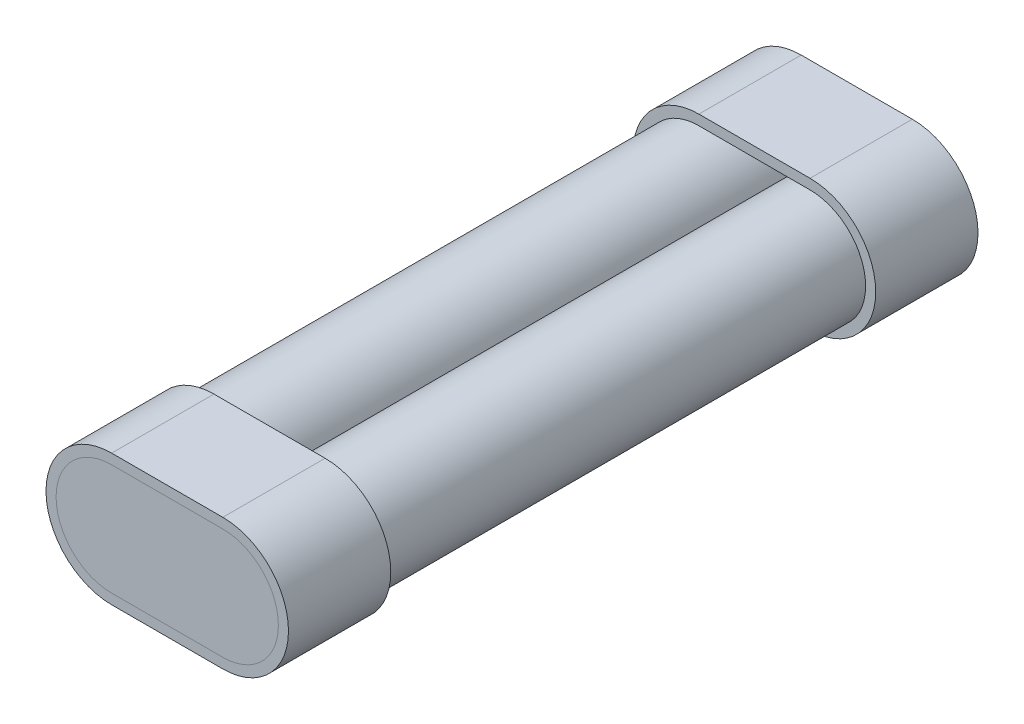
ISO-10303-21;
HEADER;
FILE_DESCRIPTION(('STEP AP214'),'2;1');
FILE_NAME('part.step','',(''),(''),'','','');
FILE_SCHEMA(('AUTOMOTIVE_DESIGN { 1 0 10303 214 1 1 1 1 }'));
ENDSEC;
DATA;
#1=APPLICATION_CONTEXT('core data for automotive mechanical design processes');
#2=APPLICATION_PROTOCOL_DEFINITION('international standard','automotive_design',2000,#1);
#3=PRODUCT_CONTEXT('',#1,'mechanical');
#4=PRODUCT('Part','Part','',(#3));
#5=PRODUCT_RELATED_PRODUCT_CATEGORY('part','',(#4));
#6=PRODUCT_DEFINITION_FORMATION('','',#4);
#7=PRODUCT_DEFINITION_CONTEXT('part definition',#1,'design');
#8=PRODUCT_DEFINITION('design','',#6,#7);
#9=PRODUCT_DEFINITION_SHAPE('','',#8);
#10=(LENGTH_UNIT() NAMED_UNIT(*) SI_UNIT(.MILLI.,.METRE.));
#11=(NAMED_UNIT(*) PLANE_ANGLE_UNIT() SI_UNIT($,.RADIAN.));
#12=(NAMED_UNIT(*) SI_UNIT($,.STERADIAN.) SOLID_ANGLE_UNIT());
#13=UNCERTAINTY_MEASURE_WITH_UNIT(LENGTH_MEASURE(1.E-05),#10,'distance_accuracy_value','');
#14=(GEOMETRIC_REPRESENTATION_CONTEXT(3) GLOBAL_UNCERTAINTY_ASSIGNED_CONTEXT((#13)) GLOBAL_UNIT_ASSIGNED_CONTEXT((#10,
#11,#12)) REPRESENTATION_CONTEXT('',''));
#15=CARTESIAN_POINT('',(0.,0.,0.));
#16=DIRECTION('',(0.,0.,1.));
#17=DIRECTION('',(1.,0.,0.));
#18=AXIS2_PLACEMENT_3D('',#15,#16,#17);
#19=CARTESIAN_POINT('',(0.,-11.,-134.5));
#20=DIRECTION('',(0.,1.,0.));
#21=DIRECTION('',(-1.,0.,0.));
#22=AXIS2_PLACEMENT_3D('',#19,#20,#21);
#23=PLANE('',#22);
#24=DIRECTION('',(-1.,0.,0.));
#25=VECTOR('',#24,1.);
#26=CARTESIAN_POINT('',(0.,-11.,-132.5));
#27=LINE('',#26,#25);
#28=CARTESIAN_POINT('',(11.,-11.,-132.5));
#29=VERTEX_POINT('',#28);
#30=CARTESIAN_POINT('',(-11.,-11.,-132.5));
#31=VERTEX_POINT('',#30);
#32=EDGE_CURVE('E118',#29,#31,#27,.T.);
#33=ORIENTED_EDGE('',*,*,#32,.T.);
#34=DIRECTION('',(0.,0.,1.));
#35=VECTOR('',#34,1.);
#36=CARTESIAN_POINT('',(-11.,-11.,-134.5));
#37=LINE('',#36,#35);
#38=CARTESIAN_POINT('',(-11.,-11.,-134.5));
#39=VERTEX_POINT('',#38);
#40=EDGE_CURVE('E13',#39,#31,#37,.T.);
#41=ORIENTED_EDGE('',*,*,#40,.F.);
#42=DIRECTION('',(-1.,0.,0.));
#43=VECTOR('',#42,1.);
#44=CARTESIAN_POINT('',(0.,-11.,-134.5));
#45=LINE('',#44,#43);
#46=CARTESIAN_POINT('',(11.,-11.,-134.5));
#47=VERTEX_POINT('',#46);
#48=EDGE_CURVE('E103',#47,#39,#45,.T.);
#49=ORIENTED_EDGE('',*,*,#48,.F.);
#50=DIRECTION('',(0.,0.,1.));
#51=VECTOR('',#50,1.);
#52=CARTESIAN_POINT('',(11.,-11.,-134.5));
#53=LINE('',#52,#51);
#54=EDGE_CURVE('E114',#47,#29,#53,.T.);
#55=ORIENTED_EDGE('',*,*,#54,.T.);
#56=EDGE_LOOP('',(#33,#41,#49,#55));
#57=FACE_BOUND('',#56,.T.);
#58=ADVANCED_FACE('F56',(#57),#23,.F.);
#59=CARTESIAN_POINT('',(-11.,0.,-134.5));
#60=DIRECTION('',(0.,0.,1.));
#61=DIRECTION('',(1.,0.,0.));
#62=AXIS2_PLACEMENT_3D('',#59,#60,#61);
#63=CYLINDRICAL_SURFACE('',#62,11.);
#64=CARTESIAN_POINT('',(-11.,0.,-132.5));
#65=DIRECTION('',(0.,0.,-1.));
#66=DIRECTION('',(-1.,0.,0.));
#67=AXIS2_PLACEMENT_3D('',#64,#65,#66);
#68=CIRCLE('',#67,11.);
#69=CARTESIAN_POINT('',(-11.,11.,-132.5));
#70=VERTEX_POINT('',#69);
#71=EDGE_CURVE('E108',#31,#70,#68,.T.);
#72=ORIENTED_EDGE('',*,*,#71,.T.);
#73=DIRECTION('',(0.,0.,1.));
#74=VECTOR('',#73,1.);
#75=CARTESIAN_POINT('',(-11.,11.,-134.5));
#76=LINE('',#75,#74);
#77=CARTESIAN_POINT('',(-11.,11.,-134.5));
#78=VERTEX_POINT('',#77);
#79=EDGE_CURVE('E64',#78,#70,#76,.T.);
#80=ORIENTED_EDGE('',*,*,#79,.F.);
#81=CARTESIAN_POINT('',(-11.,0.,-134.5));
#82=DIRECTION('',(0.,0.,-1.));
#83=DIRECTION('',(-1.,0.,0.));
#84=AXIS2_PLACEMENT_3D('',#81,#82,#83);
#85=CIRCLE('',#84,11.);
#86=EDGE_CURVE('E98',#39,#78,#85,.T.);
#87=ORIENTED_EDGE('',*,*,#86,.F.);
#88=ORIENTED_EDGE('',*,*,#40,.T.);
#89=EDGE_LOOP('',(#72,#80,#87,#88));
#90=FACE_BOUND('',#89,.T.);
#91=ADVANCED_FACE('F107',(#90),#63,.T.);
#92=CARTESIAN_POINT('',(0.,11.,-134.5));
#93=DIRECTION('',(0.,1.,0.));
#94=DIRECTION('',(-1.,0.,0.));
#95=AXIS2_PLACEMENT_3D('',#92,#93,#94);
#96=PLANE('',#95);
#97=DIRECTION('',(-1.,0.,0.));
#98=VECTOR('',#97,1.);
#99=CARTESIAN_POINT('',(0.,11.,-132.5));
#100=LINE('',#99,#98);
#101=CARTESIAN_POINT('',(11.,11.,-132.5));
#102=VERTEX_POINT('',#101);
#103=EDGE_CURVE('E122',#102,#70,#100,.T.);
#104=ORIENTED_EDGE('',*,*,#103,.F.);
#105=DIRECTION('',(0.,0.,1.));
#106=VECTOR('',#105,1.);
#107=CARTESIAN_POINT('',(11.,11.,-134.5));
#108=LINE('',#107,#106);
#109=CARTESIAN_POINT('',(11.,11.,-134.5));
#110=VERTEX_POINT('',#109);
#111=EDGE_CURVE('E88',#110,#102,#108,.T.);
#112=ORIENTED_EDGE('',*,*,#111,.F.);
#113=DIRECTION('',(-1.,0.,0.));
#114=VECTOR('',#113,1.);
#115=CARTESIAN_POINT('',(0.,11.,-134.5));
#116=LINE('',#115,#114);
#117=EDGE_CURVE('E101',#110,#78,#116,.T.);
#118=ORIENTED_EDGE('',*,*,#117,.T.);
#119=ORIENTED_EDGE('',*,*,#79,.T.);
#120=EDGE_LOOP('',(#104,#112,#118,#119));
#121=FACE_BOUND('',#120,.T.);
#122=ADVANCED_FACE('F112',(#121),#96,.T.);
#123=CARTESIAN_POINT('',(11.,0.,-134.5));
#124=DIRECTION('',(0.,0.,1.));
#125=DIRECTION('',(1.,0.,0.));
#126=AXIS2_PLACEMENT_3D('',#123,#124,#125);
#127=CYLINDRICAL_SURFACE('',#126,11.);
#128=CARTESIAN_POINT('',(11.,0.,-132.5));
#129=DIRECTION('',(0.,0.,-1.));
#130=DIRECTION('',(-1.,0.,0.));
#131=AXIS2_PLACEMENT_3D('',#128,#129,#130);
#132=CIRCLE('',#131,11.);
#133=EDGE_CURVE('E91',#102,#29,#132,.T.);
#134=ORIENTED_EDGE('',*,*,#133,.T.);
#135=ORIENTED_EDGE('',*,*,#54,.F.);
#136=CARTESIAN_POINT('',(11.,0.,-134.5));
#137=DIRECTION('',(0.,0.,-1.));
#138=DIRECTION('',(-1.,0.,0.));
#139=AXIS2_PLACEMENT_3D('',#136,#137,#138);
#140=CIRCLE('',#139,11.);
#141=EDGE_CURVE('E72',#110,#47,#140,.T.);
#142=ORIENTED_EDGE('',*,*,#141,.F.);
#143=ORIENTED_EDGE('',*,*,#111,.T.);
#144=EDGE_LOOP('',(#134,#135,#142,#143));
#145=FACE_BOUND('',#144,.T.);
#146=ADVANCED_FACE('F135',(#145),#127,.T.);
#147=CARTESIAN_POINT('',(0.,0.,-134.5));
#148=DIRECTION('',(0.,0.,-1.));
#149=DIRECTION('',(-1.,0.,0.));
#150=AXIS2_PLACEMENT_3D('',#147,#148,#149);
#151=PLANE('',#150);
#152=ORIENTED_EDGE('',*,*,#48,.T.);
#153=ORIENTED_EDGE('',*,*,#86,.T.);
#154=ORIENTED_EDGE('',*,*,#117,.F.);
#155=ORIENTED_EDGE('',*,*,#141,.T.);
#156=EDGE_LOOP('',(#152,#153,#154,#155));
#157=FACE_BOUND('',#156,.T.);
#158=ADVANCED_FACE('F99',(#157),#151,.T.);
#159=CARTESIAN_POINT('',(0.,0.,-132.5));
#160=DIRECTION('',(0.,0.,-1.));
#161=DIRECTION('',(-1.,0.,0.));
#162=AXIS2_PLACEMENT_3D('',#159,#160,#161);
#163=PLANE('',#162);
#164=ORIENTED_EDGE('',*,*,#32,.F.);
#165=ORIENTED_EDGE('',*,*,#133,.F.);
#166=ORIENTED_EDGE('',*,*,#103,.T.);
#167=ORIENTED_EDGE('',*,*,#71,.F.);
#168=EDGE_LOOP('',(#164,#165,#166,#167));
#169=FACE_BOUND('',#168,.T.);
#170=ADVANCED_FACE('F129',(#169),#163,.F.);
#171=CLOSED_SHELL('',(#58,#91,#122,#146,#158,#170));
#172=MANIFOLD_SOLID_BREP('B2',#171);
#173=CARTESIAN_POINT('',(0.,-13.,-134.5));
#174=DIRECTION('',(0.,1.,0.));
#175=DIRECTION('',(0.,0.,1.));
#176=AXIS2_PLACEMENT_3D('',#173,#174,#175);
#177=PLANE('',#176);
#178=DIRECTION('',(0.,0.,1.));
#179=VECTOR('',#178,1.);
#180=CARTESIAN_POINT('',(11.,-13.,-134.5));
#181=LINE('',#180,#179);
#182=CARTESIAN_POINT('',(11.,-13.,-134.5));
#183=VERTEX_POINT('',#182);
#184=CARTESIAN_POINT('',(11.,-13.,-114.25));
#185=VERTEX_POINT('',#184);
#186=EDGE_CURVE('E300',#183,#185,#181,.T.);
#187=ORIENTED_EDGE('',*,*,#186,.T.);
#188=DIRECTION('',(-1.,0.,0.));
#189=VECTOR('',#188,1.);
#190=CARTESIAN_POINT('',(0.,-13.,-114.25));
#191=LINE('',#190,#189);
#192=CARTESIAN_POINT('',(-11.,-13.,-114.25));
#193=VERTEX_POINT('',#192);
#194=EDGE_CURVE('E319',#185,#193,#191,.T.);
#195=ORIENTED_EDGE('',*,*,#194,.T.);
#196=DIRECTION('',(0.,0.,1.));
#197=VECTOR('',#196,1.);
#198=CARTESIAN_POINT('',(-11.,-13.,-134.5));
#199=LINE('',#198,#197);
#200=CARTESIAN_POINT('',(-11.,-13.,-134.5));
#201=VERTEX_POINT('',#200);
#202=EDGE_CURVE('E54',#201,#193,#199,.T.);
#203=ORIENTED_EDGE('',*,*,#202,.F.);
#204=DIRECTION('',(-1.,0.,0.));
#205=VECTOR('',#204,1.);
#206=CARTESIAN_POINT('',(0.,-13.,-134.5));
#207=LINE('',#206,#205);
#208=EDGE_CURVE('E340',#183,#201,#207,.T.);
#209=ORIENTED_EDGE('',*,*,#208,.F.);
#210=EDGE_LOOP('',(#187,#195,#203,#209));
#211=FACE_BOUND('',#210,.T.);
#212=ADVANCED_FACE('F223',(#211),#177,.F.);
#213=CARTESIAN_POINT('',(-11.,0.,-134.5));
#214=DIRECTION('',(0.,0.,1.));
#215=DIRECTION('',(1.,0.,0.));
#216=AXIS2_PLACEMENT_3D('',#213,#214,#215);
#217=CYLINDRICAL_SURFACE('',#216,13.);
#218=ORIENTED_EDGE('',*,*,#202,.T.);
#219=CARTESIAN_POINT('',(-11.,0.,-114.25));
#220=DIRECTION('',(0.,0.,-1.));
#221=DIRECTION('',(-1.,0.,0.));
#222=AXIS2_PLACEMENT_3D('',#219,#220,#221);
#223=CIRCLE('',#222,13.);
#224=CARTESIAN_POINT('',(-11.,13.,-114.25));
#225=VERTEX_POINT('',#224);
#226=EDGE_CURVE('E322',#193,#225,#223,.T.);
#227=ORIENTED_EDGE('',*,*,#226,.T.);
#228=DIRECTION('',(0.,0.,1.));
#229=VECTOR('',#228,1.);
#230=CARTESIAN_POINT('',(-11.,13.,-134.5));
#231=LINE('',#230,#229);
#232=CARTESIAN_POINT('',(-11.,13.,-134.5));
#233=VERTEX_POINT('',#232);
#234=EDGE_CURVE('E232',#233,#225,#231,.T.);
#235=ORIENTED_EDGE('',*,*,#234,.F.);
#236=CARTESIAN_POINT('',(-11.,0.,-134.5));
#237=DIRECTION('',(0.,0.,-1.));
#238=DIRECTION('',(-1.,0.,0.));
#239=AXIS2_PLACEMENT_3D('',#236,#237,#238);
#240=CIRCLE('',#239,13.);
#241=EDGE_CURVE('E342',#201,#233,#240,.T.);
#242=ORIENTED_EDGE('',*,*,#241,.F.);
#243=EDGE_LOOP('',(#218,#227,#235,#242));
#244=FACE_BOUND('',#243,.T.);
#245=ADVANCED_FACE('F372',(#244),#217,.T.);
#246=CARTESIAN_POINT('',(0.,13.,-134.5));
#247=DIRECTION('',(0.,1.,0.));
#248=DIRECTION('',(0.,0.,1.));
#249=AXIS2_PLACEMENT_3D('',#246,#247,#248);
#250=PLANE('',#249);
#251=ORIENTED_EDGE('',*,*,#234,.T.);
#252=DIRECTION('',(-1.,0.,0.));
#253=VECTOR('',#252,1.);
#254=CARTESIAN_POINT('',(0.,13.,-114.25));
#255=LINE('',#254,#253);
#256=CARTESIAN_POINT('',(11.,13.,-114.25));
#257=VERTEX_POINT('',#256);
#258=EDGE_CURVE('E325',#257,#225,#255,.T.);
#259=ORIENTED_EDGE('',*,*,#258,.F.);
#260=DIRECTION('',(0.,0.,1.));
#261=VECTOR('',#260,1.);
#262=CARTESIAN_POINT('',(11.,13.,-134.5));
#263=LINE('',#262,#261);
#264=CARTESIAN_POINT('',(11.,13.,-134.5));
#265=VERTEX_POINT('',#264);
#266=EDGE_CURVE('E248',#265,#257,#263,.T.);
#267=ORIENTED_EDGE('',*,*,#266,.F.);
#268=DIRECTION('',(-1.,0.,0.));
#269=VECTOR('',#268,1.);
#270=CARTESIAN_POINT('',(0.,13.,-134.5));
#271=LINE('',#270,#269);
#272=EDGE_CURVE('E344',#265,#233,#271,.T.);
#273=ORIENTED_EDGE('',*,*,#272,.T.);
#274=EDGE_LOOP('',(#251,#259,#267,#273));
#275=FACE_BOUND('',#274,.T.);
#276=ADVANCED_FACE('F377',(#275),#250,.T.);
#277=CARTESIAN_POINT('',(11.,0.,-134.5));
#278=DIRECTION('',(0.,0.,1.));
#279=DIRECTION('',(1.,0.,0.));
#280=AXIS2_PLACEMENT_3D('',#277,#278,#279);
#281=CYLINDRICAL_SURFACE('',#280,11.);
#282=DIRECTION('',(0.,0.,1.));
#283=VECTOR('',#282,1.);
#284=CARTESIAN_POINT('',(11.,-11.,-134.5));
#285=LINE('',#284,#283);
#286=CARTESIAN_POINT('',(11.,-11.,-134.5));
#287=VERTEX_POINT('',#286);
#288=CARTESIAN_POINT('',(11.,-11.,-114.25));
#289=VERTEX_POINT('',#288);
#290=EDGE_CURVE('E304',#287,#289,#285,.T.);
#291=ORIENTED_EDGE('',*,*,#290,.T.);
#292=CARTESIAN_POINT('',(11.,0.,-114.25));
#293=DIRECTION('',(0.,0.,-1.));
#294=DIRECTION('',(-1.,0.,0.));
#295=AXIS2_PLACEMENT_3D('',#292,#293,#294);
#296=CIRCLE('',#295,11.);
#297=CARTESIAN_POINT('',(11.,11.,-114.25));
#298=VERTEX_POINT('',#297);
#299=EDGE_CURVE('E303',#298,#289,#296,.T.);
#300=ORIENTED_EDGE('',*,*,#299,.F.);
#301=DIRECTION('',(0.,0.,1.));
#302=VECTOR('',#301,1.);
#303=CARTESIAN_POINT('',(11.,11.,-134.5));
#304=LINE('',#303,#302);
#305=CARTESIAN_POINT('',(11.,11.,-134.5));
#306=VERTEX_POINT('',#305);
#307=EDGE_CURVE('E227',#306,#298,#304,.T.);
#308=ORIENTED_EDGE('',*,*,#307,.F.);
#309=CARTESIAN_POINT('',(11.,0.,-134.5));
#310=DIRECTION('',(0.,0.,-1.));
#311=DIRECTION('',(-1.,0.,0.));
#312=AXIS2_PLACEMENT_3D('',#309,#310,#311);
#313=CIRCLE('',#312,11.);
#314=EDGE_CURVE('E331',#306,#287,#313,.T.);
#315=ORIENTED_EDGE('',*,*,#314,.T.);
#316=EDGE_LOOP('',(#291,#300,#308,#315));
#317=FACE_BOUND('',#316,.T.);
#318=ADVANCED_FACE('F225',(#317),#281,.F.);
#319=CARTESIAN_POINT('',(0.,11.,-134.5));
#320=DIRECTION('',(0.,1.,0.));
#321=DIRECTION('',(-1.,0.,0.));
#322=AXIS2_PLACEMENT_3D('',#319,#320,#321);
#323=PLANE('',#322);
#324=ORIENTED_EDGE('',*,*,#307,.T.);
#325=DIRECTION('',(-1.,0.,0.));
#326=VECTOR('',#325,1.);
#327=CARTESIAN_POINT('',(0.,11.,-114.25));
#328=LINE('',#327,#326);
#329=CARTESIAN_POINT('',(-11.,11.,-114.25));
#330=VERTEX_POINT('',#329);
#331=EDGE_CURVE('E295',#298,#330,#328,.T.);
#332=ORIENTED_EDGE('',*,*,#331,.T.);
#333=DIRECTION('',(0.,0.,1.));
#334=VECTOR('',#333,1.);
#335=CARTESIAN_POINT('',(-11.,11.,-134.5));
#336=LINE('',#335,#334);
#337=CARTESIAN_POINT('',(-11.,11.,-134.5));
#338=VERTEX_POINT('',#337);
#339=EDGE_CURVE('E301',#338,#330,#336,.T.);
#340=ORIENTED_EDGE('',*,*,#339,.F.);
#341=DIRECTION('',(-1.,0.,0.));
#342=VECTOR('',#341,1.);
#343=CARTESIAN_POINT('',(0.,11.,-134.5));
#344=LINE('',#343,#342);
#345=EDGE_CURVE('E296',#306,#338,#344,.T.);
#346=ORIENTED_EDGE('',*,*,#345,.F.);
#347=EDGE_LOOP('',(#324,#332,#340,#346));
#348=FACE_BOUND('',#347,.T.);
#349=ADVANCED_FACE('F292',(#348),#323,.F.);
#350=CARTESIAN_POINT('',(-11.,0.,-134.5));
#351=DIRECTION('',(0.,0.,1.));
#352=DIRECTION('',(1.,0.,0.));
#353=AXIS2_PLACEMENT_3D('',#350,#351,#352);
#354=CYLINDRICAL_SURFACE('',#353,11.);
#355=ORIENTED_EDGE('',*,*,#339,.T.);
#356=CARTESIAN_POINT('',(-11.,0.,-114.25));
#357=DIRECTION('',(0.,0.,-1.));
#358=DIRECTION('',(-1.,0.,0.));
#359=AXIS2_PLACEMENT_3D('',#356,#357,#358);
#360=CIRCLE('',#359,11.);
#361=CARTESIAN_POINT('',(-11.,-11.,-114.25));
#362=VERTEX_POINT('',#361);
#363=EDGE_CURVE('E313',#362,#330,#360,.T.);
#364=ORIENTED_EDGE('',*,*,#363,.F.);
#365=DIRECTION('',(0.,0.,1.));
#366=VECTOR('',#365,1.);
#367=CARTESIAN_POINT('',(-11.,-11.,-134.5));
#368=LINE('',#367,#366);
#369=CARTESIAN_POINT('',(-11.,-11.,-134.5));
#370=VERTEX_POINT('',#369);
#371=EDGE_CURVE('E351',#370,#362,#368,.T.);
#372=ORIENTED_EDGE('',*,*,#371,.F.);
#373=CARTESIAN_POINT('',(-11.,0.,-134.5));
#374=DIRECTION('',(0.,0.,-1.));
#375=DIRECTION('',(-1.,0.,0.));
#376=AXIS2_PLACEMENT_3D('',#373,#374,#375);
#377=CIRCLE('',#376,11.);
#378=EDGE_CURVE('E334',#370,#338,#377,.T.);
#379=ORIENTED_EDGE('',*,*,#378,.T.);
#380=EDGE_LOOP('',(#355,#364,#372,#379));
#381=FACE_BOUND('',#380,.T.);
#382=ADVANCED_FACE('F353',(#381),#354,.F.);
#383=CARTESIAN_POINT('',(0.,-11.,-134.5));
#384=DIRECTION('',(0.,1.,0.));
#385=DIRECTION('',(-1.,0.,0.));
#386=AXIS2_PLACEMENT_3D('',#383,#384,#385);
#387=PLANE('',#386);
#388=ORIENTED_EDGE('',*,*,#371,.T.);
#389=DIRECTION('',(-1.,0.,0.));
#390=VECTOR('',#389,1.);
#391=CARTESIAN_POINT('',(0.,-11.,-114.25));
#392=LINE('',#391,#390);
#393=EDGE_CURVE('E315',#289,#362,#392,.T.);
#394=ORIENTED_EDGE('',*,*,#393,.F.);
#395=ORIENTED_EDGE('',*,*,#290,.F.);
#396=DIRECTION('',(-1.,0.,0.));
#397=VECTOR('',#396,1.);
#398=CARTESIAN_POINT('',(0.,-11.,-134.5));
#399=LINE('',#398,#397);
#400=EDGE_CURVE('E337',#287,#370,#399,.T.);
#401=ORIENTED_EDGE('',*,*,#400,.T.);
#402=EDGE_LOOP('',(#388,#394,#395,#401));
#403=FACE_BOUND('',#402,.T.);
#404=ADVANCED_FACE('F359',(#403),#387,.T.);
#405=CARTESIAN_POINT('',(11.,0.,-134.5));
#406=DIRECTION('',(0.,0.,1.));
#407=DIRECTION('',(1.,0.,0.));
#408=AXIS2_PLACEMENT_3D('',#405,#406,#407);
#409=CYLINDRICAL_SURFACE('',#408,13.);
#410=ORIENTED_EDGE('',*,*,#266,.T.);
#411=CARTESIAN_POINT('',(11.,0.,-114.25));
#412=DIRECTION('',(0.,0.,-1.));
#413=DIRECTION('',(-1.,0.,0.));
#414=AXIS2_PLACEMENT_3D('',#411,#412,#413);
#415=CIRCLE('',#414,13.);
#416=EDGE_CURVE('E328',#257,#185,#415,.T.);
#417=ORIENTED_EDGE('',*,*,#416,.T.);
#418=ORIENTED_EDGE('',*,*,#186,.F.);
#419=CARTESIAN_POINT('',(11.,0.,-134.5));
#420=DIRECTION('',(0.,0.,-1.));
#421=DIRECTION('',(-1.,0.,0.));
#422=AXIS2_PLACEMENT_3D('',#419,#420,#421);
#423=CIRCLE('',#422,13.);
#424=EDGE_CURVE('E240',#265,#183,#423,.T.);
#425=ORIENTED_EDGE('',*,*,#424,.F.);
#426=EDGE_LOOP('',(#410,#417,#418,#425));
#427=FACE_BOUND('',#426,.T.);
#428=ADVANCED_FACE('F361',(#427),#409,.T.);
#429=CARTESIAN_POINT('',(0.,0.,-134.5));
#430=DIRECTION('',(0.,0.,-1.));
#431=DIRECTION('',(-1.,0.,0.));
#432=AXIS2_PLACEMENT_3D('',#429,#430,#431);
#433=PLANE('',#432);
#434=ORIENTED_EDGE('',*,*,#314,.F.);
#435=ORIENTED_EDGE('',*,*,#345,.T.);
#436=ORIENTED_EDGE('',*,*,#378,.F.);
#437=ORIENTED_EDGE('',*,*,#400,.F.);
#438=EDGE_LOOP('',(#434,#435,#436,#437));
#439=FACE_BOUND('',#438,.T.);
#440=ORIENTED_EDGE('',*,*,#208,.T.);
#441=ORIENTED_EDGE('',*,*,#241,.T.);
#442=ORIENTED_EDGE('',*,*,#272,.F.);
#443=ORIENTED_EDGE('',*,*,#424,.T.);
#444=EDGE_LOOP('',(#440,#441,#442,#443));
#445=FACE_BOUND('',#444,.T.);
#446=ADVANCED_FACE('F357',(#439,#445),#433,.T.);
#447=CARTESIAN_POINT('',(0.,0.,-114.25));
#448=DIRECTION('',(0.,0.,-1.));
#449=DIRECTION('',(-1.,0.,0.));
#450=AXIS2_PLACEMENT_3D('',#447,#448,#449);
#451=PLANE('',#450);
#452=ORIENTED_EDGE('',*,*,#299,.T.);
#453=ORIENTED_EDGE('',*,*,#393,.T.);
#454=ORIENTED_EDGE('',*,*,#363,.T.);
#455=ORIENTED_EDGE('',*,*,#331,.F.);
#456=EDGE_LOOP('',(#452,#453,#454,#455));
#457=FACE_BOUND('',#456,.T.);
#458=ORIENTED_EDGE('',*,*,#194,.F.);
#459=ORIENTED_EDGE('',*,*,#416,.F.);
#460=ORIENTED_EDGE('',*,*,#258,.T.);
#461=ORIENTED_EDGE('',*,*,#226,.F.);
#462=EDGE_LOOP('',(#458,#459,#460,#461));
#463=FACE_BOUND('',#462,.T.);
#464=ADVANCED_FACE('F310',(#457,#463),#451,.F.);
#465=CLOSED_SHELL('',(#212,#245,#276,#318,#349,#382,#404,#428,#446,#464));
#466=MANIFOLD_SOLID_BREP('B7',#465);
#467=CARTESIAN_POINT('',(0.,-11.,2.));
#468=DIRECTION('',(0.,1.,0.));
#469=DIRECTION('',(0.,0.,1.));
#470=AXIS2_PLACEMENT_3D('',#467,#468,#469);
#471=PLANE('',#470);
#472=DIRECTION('',(1.,0.,0.));
#473=VECTOR('',#472,1.);
#474=CARTESIAN_POINT('',(0.,-11.,0.));
#475=LINE('',#474,#473);
#476=CARTESIAN_POINT('',(-11.,-11.,0.));
#477=VERTEX_POINT('',#476);
#478=CARTESIAN_POINT('',(11.,-11.,0.));
#479=VERTEX_POINT('',#478);
#480=EDGE_CURVE('E548',#477,#479,#475,.T.);
#481=ORIENTED_EDGE('',*,*,#480,.T.);
#482=DIRECTION('',(0.,0.,-1.));
#483=VECTOR('',#482,1.);
#484=CARTESIAN_POINT('',(11.,-11.,2.));
#485=LINE('',#484,#483);
#486=CARTESIAN_POINT('',(11.,-11.,2.));
#487=VERTEX_POINT('',#486);
#488=EDGE_CURVE('E221',#487,#479,#485,.T.);
#489=ORIENTED_EDGE('',*,*,#488,.F.);
#490=DIRECTION('',(1.,0.,0.));
#491=VECTOR('',#490,1.);
#492=CARTESIAN_POINT('',(0.,-11.,2.));
#493=LINE('',#492,#491);
#494=CARTESIAN_POINT('',(-11.,-11.,2.));
#495=VERTEX_POINT('',#494);
#496=EDGE_CURVE('E533',#495,#487,#493,.T.);
#497=ORIENTED_EDGE('',*,*,#496,.F.);
#498=DIRECTION('',(0.,0.,-1.));
#499=VECTOR('',#498,1.);
#500=CARTESIAN_POINT('',(-11.,-11.,2.));
#501=LINE('',#500,#499);
#502=EDGE_CURVE('E544',#495,#477,#501,.T.);
#503=ORIENTED_EDGE('',*,*,#502,.T.);
#504=EDGE_LOOP('',(#481,#489,#497,#503));
#505=FACE_BOUND('',#504,.T.);
#506=ADVANCED_FACE('F486',(#505),#471,.F.);
#507=CARTESIAN_POINT('',(11.,0.,2.));
#508=DIRECTION('',(0.,0.,-1.));
#509=DIRECTION('',(-1.,0.,0.));
#510=AXIS2_PLACEMENT_3D('',#507,#508,#509);
#511=CYLINDRICAL_SURFACE('',#510,11.);
#512=CARTESIAN_POINT('',(11.,0.,0.));
#513=DIRECTION('',(0.,0.,1.));
#514=DIRECTION('',(1.,0.,0.));
#515=AXIS2_PLACEMENT_3D('',#512,#513,#514);
#516=CIRCLE('',#515,11.);
#517=CARTESIAN_POINT('',(11.,11.,0.));
#518=VERTEX_POINT('',#517);
#519=EDGE_CURVE('E538',#479,#518,#516,.T.);
#520=ORIENTED_EDGE('',*,*,#519,.T.);
#521=DIRECTION('',(0.,0.,-1.));
#522=VECTOR('',#521,1.);
#523=CARTESIAN_POINT('',(11.,11.,2.));
#524=LINE('',#523,#522);
#525=CARTESIAN_POINT('',(11.,11.,2.));
#526=VERTEX_POINT('',#525);
#527=EDGE_CURVE('E494',#526,#518,#524,.T.);
#528=ORIENTED_EDGE('',*,*,#527,.F.);
#529=CARTESIAN_POINT('',(11.,0.,2.));
#530=DIRECTION('',(0.,0.,1.));
#531=DIRECTION('',(1.,0.,0.));
#532=AXIS2_PLACEMENT_3D('',#529,#530,#531);
#533=CIRCLE('',#532,11.);
#534=EDGE_CURVE('E528',#487,#526,#533,.T.);
#535=ORIENTED_EDGE('',*,*,#534,.F.);
#536=ORIENTED_EDGE('',*,*,#488,.T.);
#537=EDGE_LOOP('',(#520,#528,#535,#536));
#538=FACE_BOUND('',#537,.T.);
#539=ADVANCED_FACE('F537',(#538),#511,.T.);
#540=CARTESIAN_POINT('',(0.,11.,2.));
#541=DIRECTION('',(0.,1.,0.));
#542=DIRECTION('',(0.,0.,1.));
#543=AXIS2_PLACEMENT_3D('',#540,#541,#542);
#544=PLANE('',#543);
#545=DIRECTION('',(1.,0.,0.));
#546=VECTOR('',#545,1.);
#547=CARTESIAN_POINT('',(0.,11.,0.));
#548=LINE('',#547,#546);
#549=CARTESIAN_POINT('',(-11.,11.,0.));
#550=VERTEX_POINT('',#549);
#551=EDGE_CURVE('E552',#550,#518,#548,.T.);
#552=ORIENTED_EDGE('',*,*,#551,.F.);
#553=DIRECTION('',(0.,0.,-1.));
#554=VECTOR('',#553,1.);
#555=CARTESIAN_POINT('',(-11.,11.,2.));
#556=LINE('',#555,#554);
#557=CARTESIAN_POINT('',(-11.,11.,2.));
#558=VERTEX_POINT('',#557);
#559=EDGE_CURVE('E518',#558,#550,#556,.T.);
#560=ORIENTED_EDGE('',*,*,#559,.F.);
#561=DIRECTION('',(1.,0.,0.));
#562=VECTOR('',#561,1.);
#563=CARTESIAN_POINT('',(0.,11.,2.));
#564=LINE('',#563,#562);
#565=EDGE_CURVE('E531',#558,#526,#564,.T.);
#566=ORIENTED_EDGE('',*,*,#565,.T.);
#567=ORIENTED_EDGE('',*,*,#527,.T.);
#568=EDGE_LOOP('',(#552,#560,#566,#567));
#569=FACE_BOUND('',#568,.T.);
#570=ADVANCED_FACE('F542',(#569),#544,.T.);
#571=CARTESIAN_POINT('',(-11.,0.,2.));
#572=DIRECTION('',(0.,0.,-1.));
#573=DIRECTION('',(-1.,0.,0.));
#574=AXIS2_PLACEMENT_3D('',#571,#572,#573);
#575=CYLINDRICAL_SURFACE('',#574,11.);
#576=CARTESIAN_POINT('',(-11.,0.,0.));
#577=DIRECTION('',(0.,0.,1.));
#578=DIRECTION('',(1.,0.,0.));
#579=AXIS2_PLACEMENT_3D('',#576,#577,#578);
#580=CIRCLE('',#579,11.);
#581=EDGE_CURVE('E521',#550,#477,#580,.T.);
#582=ORIENTED_EDGE('',*,*,#581,.T.);
#583=ORIENTED_EDGE('',*,*,#502,.F.);
#584=CARTESIAN_POINT('',(-11.,0.,2.));
#585=DIRECTION('',(0.,0.,1.));
#586=DIRECTION('',(1.,0.,0.));
#587=AXIS2_PLACEMENT_3D('',#584,#585,#586);
#588=CIRCLE('',#587,11.);
#589=EDGE_CURVE('E502',#558,#495,#588,.T.);
#590=ORIENTED_EDGE('',*,*,#589,.F.);
#591=ORIENTED_EDGE('',*,*,#559,.T.);
#592=EDGE_LOOP('',(#582,#583,#590,#591));
#593=FACE_BOUND('',#592,.T.);
#594=ADVANCED_FACE('F565',(#593),#575,.T.);
#595=CARTESIAN_POINT('',(0.,0.,2.));
#596=DIRECTION('',(0.,0.,1.));
#597=DIRECTION('',(1.,0.,0.));
#598=AXIS2_PLACEMENT_3D('',#595,#596,#597);
#599=PLANE('',#598);
#600=ORIENTED_EDGE('',*,*,#496,.T.);
#601=ORIENTED_EDGE('',*,*,#534,.T.);
#602=ORIENTED_EDGE('',*,*,#565,.F.);
#603=ORIENTED_EDGE('',*,*,#589,.T.);
#604=EDGE_LOOP('',(#600,#601,#602,#603));
#605=FACE_BOUND('',#604,.T.);
#606=ADVANCED_FACE('F529',(#605),#599,.T.);
#607=CARTESIAN_POINT('',(0.,0.,0.));
#608=DIRECTION('',(0.,0.,1.));
#609=DIRECTION('',(1.,0.,0.));
#610=AXIS2_PLACEMENT_3D('',#607,#608,#609);
#611=PLANE('',#610);
#612=ORIENTED_EDGE('',*,*,#480,.F.);
#613=ORIENTED_EDGE('',*,*,#581,.F.);
#614=ORIENTED_EDGE('',*,*,#551,.T.);
#615=ORIENTED_EDGE('',*,*,#519,.F.);
#616=EDGE_LOOP('',(#612,#613,#614,#615));
#617=FACE_BOUND('',#616,.T.);
#618=ADVANCED_FACE('F559',(#617),#611,.F.);
#619=CLOSED_SHELL('',(#506,#539,#570,#594,#606,#618));
#620=MANIFOLD_SOLID_BREP('B48',#619);
#621=CARTESIAN_POINT('',(0.,-13.,2.));
#622=DIRECTION('',(0.,1.,0.));
#623=DIRECTION('',(0.,0.,1.));
#624=AXIS2_PLACEMENT_3D('',#621,#622,#623);
#625=PLANE('',#624);
#626=DIRECTION('',(0.,0.,-1.));
#627=VECTOR('',#626,1.);
#628=CARTESIAN_POINT('',(-11.,-13.,2.));
#629=LINE('',#628,#627);
#630=CARTESIAN_POINT('',(-11.,-13.,2.));
#631=VERTEX_POINT('',#630);
#632=CARTESIAN_POINT('',(-11.,-13.,-18.25));
#633=VERTEX_POINT('',#632);
#634=EDGE_CURVE('E725',#631,#633,#629,.T.);
#635=ORIENTED_EDGE('',*,*,#634,.T.);
#636=DIRECTION('',(1.,0.,0.));
#637=VECTOR('',#636,1.);
#638=CARTESIAN_POINT('',(0.,-13.,-18.25));
#639=LINE('',#638,#637);
#640=CARTESIAN_POINT('',(11.,-13.,-18.25));
#641=VERTEX_POINT('',#640);
#642=EDGE_CURVE('E745',#633,#641,#639,.T.);
#643=ORIENTED_EDGE('',*,*,#642,.T.);
#644=DIRECTION('',(0.,0.,-1.));
#645=VECTOR('',#644,1.);
#646=CARTESIAN_POINT('',(11.,-13.,2.));
#647=LINE('',#646,#645);
#648=CARTESIAN_POINT('',(11.,-13.,2.));
#649=VERTEX_POINT('',#648);
#650=EDGE_CURVE('E484',#649,#641,#647,.T.);
#651=ORIENTED_EDGE('',*,*,#650,.F.);
#652=DIRECTION('',(1.,0.,0.));
#653=VECTOR('',#652,1.);
#654=CARTESIAN_POINT('',(0.,-13.,2.));
#655=LINE('',#654,#653);
#656=EDGE_CURVE('E765',#631,#649,#655,.T.);
#657=ORIENTED_EDGE('',*,*,#656,.F.);
#658=EDGE_LOOP('',(#635,#643,#651,#657));
#659=FACE_BOUND('',#658,.T.);
#660=ADVANCED_FACE('F648',(#659),#625,.F.);
#661=CARTESIAN_POINT('',(11.,0.,2.));
#662=DIRECTION('',(0.,0.,-1.));
#663=DIRECTION('',(-1.,0.,0.));
#664=AXIS2_PLACEMENT_3D('',#661,#662,#663);
#665=CYLINDRICAL_SURFACE('',#664,13.);
#666=ORIENTED_EDGE('',*,*,#650,.T.);
#667=CARTESIAN_POINT('',(11.,0.,-18.25));
#668=DIRECTION('',(0.,0.,1.));
#669=DIRECTION('',(1.,0.,0.));
#670=AXIS2_PLACEMENT_3D('',#667,#668,#669);
#671=CIRCLE('',#670,13.);
#672=CARTESIAN_POINT('',(11.,13.,-18.25));
#673=VERTEX_POINT('',#672);
#674=EDGE_CURVE('E748',#641,#673,#671,.T.);
#675=ORIENTED_EDGE('',*,*,#674,.T.);
#676=DIRECTION('',(0.,0.,-1.));
#677=VECTOR('',#676,1.);
#678=CARTESIAN_POINT('',(11.,13.,2.));
#679=LINE('',#678,#677);
#680=CARTESIAN_POINT('',(11.,13.,2.));
#681=VERTEX_POINT('',#680);
#682=EDGE_CURVE('E657',#681,#673,#679,.T.);
#683=ORIENTED_EDGE('',*,*,#682,.F.);
#684=CARTESIAN_POINT('',(11.,0.,2.));
#685=DIRECTION('',(0.,0.,1.));
#686=DIRECTION('',(1.,0.,0.));
#687=AXIS2_PLACEMENT_3D('',#684,#685,#686);
#688=CIRCLE('',#687,13.);
#689=EDGE_CURVE('E767',#649,#681,#688,.T.);
#690=ORIENTED_EDGE('',*,*,#689,.F.);
#691=EDGE_LOOP('',(#666,#675,#683,#690));
#692=FACE_BOUND('',#691,.T.);
#693=ADVANCED_FACE('F797',(#692),#665,.T.);
#694=CARTESIAN_POINT('',(0.,13.,2.));
#695=DIRECTION('',(0.,1.,0.));
#696=DIRECTION('',(0.,0.,1.));
#697=AXIS2_PLACEMENT_3D('',#694,#695,#696);
#698=PLANE('',#697);
#699=ORIENTED_EDGE('',*,*,#682,.T.);
#700=DIRECTION('',(1.,0.,0.));
#701=VECTOR('',#700,1.);
#702=CARTESIAN_POINT('',(0.,13.,-18.25));
#703=LINE('',#702,#701);
#704=CARTESIAN_POINT('',(-11.,13.,-18.25));
#705=VERTEX_POINT('',#704);
#706=EDGE_CURVE('E751',#705,#673,#703,.T.);
#707=ORIENTED_EDGE('',*,*,#706,.F.);
#708=DIRECTION('',(0.,0.,-1.));
#709=VECTOR('',#708,1.);
#710=CARTESIAN_POINT('',(-11.,13.,2.));
#711=LINE('',#710,#709);
#712=CARTESIAN_POINT('',(-11.,13.,2.));
#713=VERTEX_POINT('',#712);
#714=EDGE_CURVE('E673',#713,#705,#711,.T.);
#715=ORIENTED_EDGE('',*,*,#714,.F.);
#716=DIRECTION('',(1.,0.,0.));
#717=VECTOR('',#716,1.);
#718=CARTESIAN_POINT('',(0.,13.,2.));
#719=LINE('',#718,#717);
#720=EDGE_CURVE('E769',#713,#681,#719,.T.);
#721=ORIENTED_EDGE('',*,*,#720,.T.);
#722=EDGE_LOOP('',(#699,#707,#715,#721));
#723=FACE_BOUND('',#722,.T.);
#724=ADVANCED_FACE('F802',(#723),#698,.T.);
#725=CARTESIAN_POINT('',(11.,0.,2.));
#726=DIRECTION('',(0.,0.,-1.));
#727=DIRECTION('',(-1.,0.,0.));
#728=AXIS2_PLACEMENT_3D('',#725,#726,#727);
#729=CYLINDRICAL_SURFACE('',#728,11.);
#730=DIRECTION('',(0.,0.,-1.));
#731=VECTOR('',#730,1.);
#732=CARTESIAN_POINT('',(11.,11.,2.));
#733=LINE('',#732,#731);
#734=CARTESIAN_POINT('',(11.,11.,2.));
#735=VERTEX_POINT('',#734);
#736=CARTESIAN_POINT('',(11.,11.,-18.25));
#737=VERTEX_POINT('',#736);
#738=EDGE_CURVE('E739',#735,#737,#733,.T.);
#739=ORIENTED_EDGE('',*,*,#738,.T.);
#740=CARTESIAN_POINT('',(11.,0.,-18.25));
#741=DIRECTION('',(0.,0.,1.));
#742=DIRECTION('',(1.,0.,0.));
#743=AXIS2_PLACEMENT_3D('',#740,#741,#742);
#744=CIRCLE('',#743,11.);
#745=CARTESIAN_POINT('',(11.,-11.,-18.25));
#746=VERTEX_POINT('',#745);
#747=EDGE_CURVE('E733',#746,#737,#744,.T.);
#748=ORIENTED_EDGE('',*,*,#747,.F.);
#749=DIRECTION('',(0.,0.,-1.));
#750=VECTOR('',#749,1.);
#751=CARTESIAN_POINT('',(11.,-11.,2.));
#752=LINE('',#751,#750);
#753=CARTESIAN_POINT('',(11.,-11.,2.));
#754=VERTEX_POINT('',#753);
#755=EDGE_CURVE('E652',#754,#746,#752,.T.);
#756=ORIENTED_EDGE('',*,*,#755,.F.);
#757=CARTESIAN_POINT('',(11.,0.,2.));
#758=DIRECTION('',(0.,0.,1.));
#759=DIRECTION('',(1.,0.,0.));
#760=AXIS2_PLACEMENT_3D('',#757,#758,#759);
#761=CIRCLE('',#760,11.);
#762=EDGE_CURVE('E757',#754,#735,#761,.T.);
#763=ORIENTED_EDGE('',*,*,#762,.T.);
#764=EDGE_LOOP('',(#739,#748,#756,#763));
#765=FACE_BOUND('',#764,.T.);
#766=ADVANCED_FACE('F650',(#765),#729,.F.);
#767=CARTESIAN_POINT('',(0.,-11.,2.));
#768=DIRECTION('',(0.,1.,0.));
#769=DIRECTION('',(0.,0.,1.));
#770=AXIS2_PLACEMENT_3D('',#767,#768,#769);
#771=PLANE('',#770);
#772=ORIENTED_EDGE('',*,*,#755,.T.);
#773=DIRECTION('',(1.,0.,0.));
#774=VECTOR('',#773,1.);
#775=CARTESIAN_POINT('',(0.,-11.,-18.25));
#776=LINE('',#775,#774);
#777=CARTESIAN_POINT('',(-11.,-11.,-18.25));
#778=VERTEX_POINT('',#777);
#779=EDGE_CURVE('E718',#778,#746,#776,.T.);
#780=ORIENTED_EDGE('',*,*,#779,.F.);
#781=DIRECTION('',(0.,0.,-1.));
#782=VECTOR('',#781,1.);
#783=CARTESIAN_POINT('',(-11.,-11.,2.));
#784=LINE('',#783,#782);
#785=CARTESIAN_POINT('',(-11.,-11.,2.));
#786=VERTEX_POINT('',#785);
#787=EDGE_CURVE('E726',#786,#778,#784,.T.);
#788=ORIENTED_EDGE('',*,*,#787,.F.);
#789=DIRECTION('',(1.,0.,0.));
#790=VECTOR('',#789,1.);
#791=CARTESIAN_POINT('',(0.,-11.,2.));
#792=LINE('',#791,#790);
#793=EDGE_CURVE('E720',#786,#754,#792,.T.);
#794=ORIENTED_EDGE('',*,*,#793,.T.);
#795=EDGE_LOOP('',(#772,#780,#788,#794));
#796=FACE_BOUND('',#795,.T.);
#797=ADVANCED_FACE('F717',(#796),#771,.T.);
#798=CARTESIAN_POINT('',(-11.,0.,2.));
#799=DIRECTION('',(0.,0.,-1.));
#800=DIRECTION('',(-1.,0.,0.));
#801=AXIS2_PLACEMENT_3D('',#798,#799,#800);
#802=CYLINDRICAL_SURFACE('',#801,11.);
#803=ORIENTED_EDGE('',*,*,#787,.T.);
#804=CARTESIAN_POINT('',(-11.,0.,-18.25));
#805=DIRECTION('',(0.,0.,1.));
#806=DIRECTION('',(1.,0.,0.));
#807=AXIS2_PLACEMENT_3D('',#804,#805,#806);
#808=CIRCLE('',#807,11.);
#809=CARTESIAN_POINT('',(-11.,11.,-18.25));
#810=VERTEX_POINT('',#809);
#811=EDGE_CURVE('E736',#810,#778,#808,.T.);
#812=ORIENTED_EDGE('',*,*,#811,.F.);
#813=DIRECTION('',(0.,0.,-1.));
#814=VECTOR('',#813,1.);
#815=CARTESIAN_POINT('',(-11.,11.,2.));
#816=LINE('',#815,#814);
#817=CARTESIAN_POINT('',(-11.,11.,2.));
#818=VERTEX_POINT('',#817);
#819=EDGE_CURVE('E776',#818,#810,#816,.T.);
#820=ORIENTED_EDGE('',*,*,#819,.F.);
#821=CARTESIAN_POINT('',(-11.,0.,2.));
#822=DIRECTION('',(0.,0.,1.));
#823=DIRECTION('',(1.,0.,0.));
#824=AXIS2_PLACEMENT_3D('',#821,#822,#823);
#825=CIRCLE('',#824,11.);
#826=EDGE_CURVE('E760',#818,#786,#825,.T.);
#827=ORIENTED_EDGE('',*,*,#826,.T.);
#828=EDGE_LOOP('',(#803,#812,#820,#827));
#829=FACE_BOUND('',#828,.T.);
#830=ADVANCED_FACE('F778',(#829),#802,.F.);
#831=CARTESIAN_POINT('',(0.,11.,2.));
#832=DIRECTION('',(0.,1.,0.));
#833=DIRECTION('',(0.,0.,1.));
#834=AXIS2_PLACEMENT_3D('',#831,#832,#833);
#835=PLANE('',#834);
#836=ORIENTED_EDGE('',*,*,#819,.T.);
#837=DIRECTION('',(1.,0.,0.));
#838=VECTOR('',#837,1.);
#839=CARTESIAN_POINT('',(0.,11.,-18.25));
#840=LINE('',#839,#838);
#841=EDGE_CURVE('E743',#810,#737,#840,.T.);
#842=ORIENTED_EDGE('',*,*,#841,.T.);
#843=ORIENTED_EDGE('',*,*,#738,.F.);
#844=DIRECTION('',(1.,0.,0.));
#845=VECTOR('',#844,1.);
#846=CARTESIAN_POINT('',(0.,11.,2.));
#847=LINE('',#846,#845);
#848=EDGE_CURVE('E763',#818,#735,#847,.T.);
#849=ORIENTED_EDGE('',*,*,#848,.F.);
#850=EDGE_LOOP('',(#836,#842,#843,#849));
#851=FACE_BOUND('',#850,.T.);
#852=ADVANCED_FACE('F784',(#851),#835,.F.);
#853=CARTESIAN_POINT('',(-11.,0.,2.));
#854=DIRECTION('',(0.,0.,-1.));
#855=DIRECTION('',(-1.,0.,0.));
#856=AXIS2_PLACEMENT_3D('',#853,#854,#855);
#857=CYLINDRICAL_SURFACE('',#856,13.);
#858=ORIENTED_EDGE('',*,*,#714,.T.);
#859=CARTESIAN_POINT('',(-11.,0.,-18.25));
#860=DIRECTION('',(0.,0.,1.));
#861=DIRECTION('',(1.,0.,0.));
#862=AXIS2_PLACEMENT_3D('',#859,#860,#861);
#863=CIRCLE('',#862,13.);
#864=EDGE_CURVE('E754',#705,#633,#863,.T.);
#865=ORIENTED_EDGE('',*,*,#864,.T.);
#866=ORIENTED_EDGE('',*,*,#634,.F.);
#867=CARTESIAN_POINT('',(-11.,0.,2.));
#868=DIRECTION('',(0.,0.,1.));
#869=DIRECTION('',(1.,0.,0.));
#870=AXIS2_PLACEMENT_3D('',#867,#868,#869);
#871=CIRCLE('',#870,13.);
#872=EDGE_CURVE('E665',#713,#631,#871,.T.);
#873=ORIENTED_EDGE('',*,*,#872,.F.);
#874=EDGE_LOOP('',(#858,#865,#866,#873));
#875=FACE_BOUND('',#874,.T.);
#876=ADVANCED_FACE('F786',(#875),#857,.T.);
#877=CARTESIAN_POINT('',(0.,0.,2.));
#878=DIRECTION('',(0.,0.,1.));
#879=DIRECTION('',(1.,0.,0.));
#880=AXIS2_PLACEMENT_3D('',#877,#878,#879);
#881=PLANE('',#880);
#882=ORIENTED_EDGE('',*,*,#762,.F.);
#883=ORIENTED_EDGE('',*,*,#793,.F.);
#884=ORIENTED_EDGE('',*,*,#826,.F.);
#885=ORIENTED_EDGE('',*,*,#848,.T.);
#886=EDGE_LOOP('',(#882,#883,#884,#885));
#887=FACE_BOUND('',#886,.T.);
#888=ORIENTED_EDGE('',*,*,#656,.T.);
#889=ORIENTED_EDGE('',*,*,#689,.T.);
#890=ORIENTED_EDGE('',*,*,#720,.F.);
#891=ORIENTED_EDGE('',*,*,#872,.T.);
#892=EDGE_LOOP('',(#888,#889,#890,#891));
#893=FACE_BOUND('',#892,.T.);
#894=ADVANCED_FACE('F781',(#887,#893),#881,.T.);
#895=CARTESIAN_POINT('',(0.,0.,-18.25));
#896=DIRECTION('',(0.,0.,1.));
#897=DIRECTION('',(1.,0.,0.));
#898=AXIS2_PLACEMENT_3D('',#895,#896,#897);
#899=PLANE('',#898);
#900=ORIENTED_EDGE('',*,*,#747,.T.);
#901=ORIENTED_EDGE('',*,*,#841,.F.);
#902=ORIENTED_EDGE('',*,*,#811,.T.);
#903=ORIENTED_EDGE('',*,*,#779,.T.);
#904=EDGE_LOOP('',(#900,#901,#902,#903));
#905=FACE_BOUND('',#904,.T.);
#906=ORIENTED_EDGE('',*,*,#642,.F.);
#907=ORIENTED_EDGE('',*,*,#864,.F.);
#908=ORIENTED_EDGE('',*,*,#706,.T.);
#909=ORIENTED_EDGE('',*,*,#674,.F.);
#910=EDGE_LOOP('',(#906,#907,#908,#909));
#911=FACE_BOUND('',#910,.T.);
#912=ADVANCED_FACE('F730',(#905,#911),#899,.F.);
#913=CLOSED_SHELL('',(#660,#693,#724,#766,#797,#830,#852,#876,#894,#912));
#914=MANIFOLD_SOLID_BREP('B215',#913);
#915=CARTESIAN_POINT('',(11.,0.,-132.5));
#916=DIRECTION('',(0.,0.,1.));
#917=DIRECTION('',(1.,0.,0.));
#918=AXIS2_PLACEMENT_3D('',#915,#916,#917);
#919=CYLINDRICAL_SURFACE('',#918,11.);
#920=CARTESIAN_POINT('',(11.,0.,-132.5));
#921=DIRECTION('',(0.,0.,1.));
#922=DIRECTION('',(1.,0.,0.));
#923=AXIS2_PLACEMENT_3D('',#920,#921,#922);
#924=CIRCLE('',#923,11.);
#925=CARTESIAN_POINT('',(22.,0.,-132.5));
#926=VERTEX_POINT('',#925);
#927=EDGE_CURVE('E647',#926,#926,#924,.T.);
#928=ORIENTED_EDGE('',*,*,#927,.T.);
#929=EDGE_LOOP('',(#928));
#930=FACE_BOUND('',#929,.T.);
#931=CARTESIAN_POINT('',(11.,0.,0.));
#932=DIRECTION('',(0.,0.,1.));
#933=DIRECTION('',(1.,0.,0.));
#934=AXIS2_PLACEMENT_3D('',#931,#932,#933);
#935=CIRCLE('',#934,11.);
#936=CARTESIAN_POINT('',(22.,0.,0.));
#937=VERTEX_POINT('',#936);
#938=EDGE_CURVE('E908',#937,#937,#935,.T.);
#939=ORIENTED_EDGE('',*,*,#938,.F.);
#940=EDGE_LOOP('',(#939));
#941=FACE_BOUND('',#940,.T.);
#942=ADVANCED_FACE('F905',(#930,#941),#919,.T.);
#943=CARTESIAN_POINT('',(0.,0.,-132.5));
#944=DIRECTION('',(0.,0.,1.));
#945=DIRECTION('',(1.,0.,0.));
#946=AXIS2_PLACEMENT_3D('',#943,#944,#945);
#947=PLANE('',#946);
#948=ORIENTED_EDGE('',*,*,#927,.F.);
#949=EDGE_LOOP('',(#948));
#950=FACE_BOUND('',#949,.T.);
#951=ADVANCED_FACE('F920',(#950),#947,.F.);
#952=CARTESIAN_POINT('',(0.,0.,0.));
#953=DIRECTION('',(0.,0.,1.));
#954=DIRECTION('',(1.,0.,0.));
#955=AXIS2_PLACEMENT_3D('',#952,#953,#954);
#956=PLANE('',#955);
#957=ORIENTED_EDGE('',*,*,#938,.T.);
#958=EDGE_LOOP('',(#957));
#959=FACE_BOUND('',#958,.T.);
#960=ADVANCED_FACE('F917',(#959),#956,.T.);
#961=CLOSED_SHELL('',(#942,#951,#960));
#962=MANIFOLD_SOLID_BREP('B478',#961);
#963=CARTESIAN_POINT('',(-11.,0.,-132.5));
#964=DIRECTION('',(0.,0.,1.));
#965=DIRECTION('',(1.,0.,0.));
#966=AXIS2_PLACEMENT_3D('',#963,#964,#965);
#967=CYLINDRICAL_SURFACE('',#966,11.);
#968=CARTESIAN_POINT('',(-11.,0.,-132.5));
#969=DIRECTION('',(0.,0.,1.));
#970=DIRECTION('',(1.,0.,0.));
#971=AXIS2_PLACEMENT_3D('',#968,#969,#970);
#972=CIRCLE('',#971,11.);
#973=CARTESIAN_POINT('',(0.,0.,-132.5));
#974=VERTEX_POINT('',#973);
#975=EDGE_CURVE('E904',#974,#974,#972,.T.);
#976=ORIENTED_EDGE('',*,*,#975,.T.);
#977=EDGE_LOOP('',(#976));
#978=FACE_BOUND('',#977,.T.);
#979=CARTESIAN_POINT('',(-11.,0.,0.));
#980=DIRECTION('',(0.,0.,1.));
#981=DIRECTION('',(1.,0.,0.));
#982=AXIS2_PLACEMENT_3D('',#979,#980,#981);
#983=CIRCLE('',#982,11.);
#984=CARTESIAN_POINT('',(0.,0.,0.));
#985=VERTEX_POINT('',#984);
#986=EDGE_CURVE('E961',#985,#985,#983,.T.);
#987=ORIENTED_EDGE('',*,*,#986,.F.);
#988=EDGE_LOOP('',(#987));
#989=FACE_BOUND('',#988,.T.);
#990=ADVANCED_FACE('F958',(#978,#989),#967,.T.);
#991=CARTESIAN_POINT('',(0.,0.,-132.5));
#992=DIRECTION('',(0.,0.,1.));
#993=DIRECTION('',(1.,0.,0.));
#994=AXIS2_PLACEMENT_3D('',#991,#992,#993);
#995=PLANE('',#994);
#996=ORIENTED_EDGE('',*,*,#975,.F.);
#997=EDGE_LOOP('',(#996));
#998=FACE_BOUND('',#997,.T.);
#999=ADVANCED_FACE('F973',(#998),#995,.F.);
#1000=CARTESIAN_POINT('',(0.,0.,0.));
#1001=DIRECTION('',(0.,0.,1.));
#1002=DIRECTION('',(1.,0.,0.));
#1003=AXIS2_PLACEMENT_3D('',#1000,#1001,#1002);
#1004=PLANE('',#1003);
#1005=ORIENTED_EDGE('',*,*,#986,.T.);
#1006=EDGE_LOOP('',(#1005));
#1007=FACE_BOUND('',#1006,.T.);
#1008=ADVANCED_FACE('F970',(#1007),#1004,.T.);
#1009=CLOSED_SHELL('',(#990,#999,#1008));
#1010=MANIFOLD_SOLID_BREP('B642',#1009);
#1011=ADVANCED_BREP_SHAPE_REPRESENTATION('',(#18,#172,#466,#620,#914,#962,#1010),#14);
#1012=SHAPE_DEFINITION_REPRESENTATION(#9,#1011);
ENDSEC;
END-ISO-10303-21;
